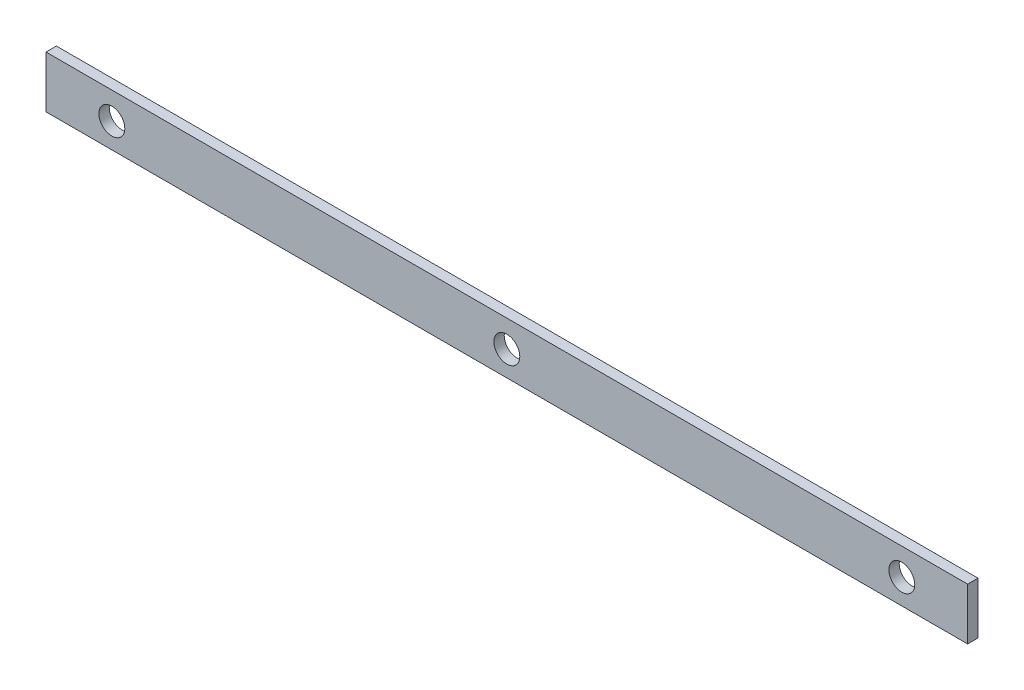
ISO-10303-21;
HEADER;
FILE_DESCRIPTION(('STEP AP214'),'2;1');
FILE_NAME('part.step','',(''),(''),'','','');
FILE_SCHEMA(('AUTOMOTIVE_DESIGN { 1 0 10303 214 1 1 1 1 }'));
ENDSEC;
DATA;
#1=APPLICATION_CONTEXT('core data for automotive mechanical design processes');
#2=APPLICATION_PROTOCOL_DEFINITION('international standard','automotive_design',2000,#1);
#3=PRODUCT_CONTEXT('',#1,'mechanical');
#4=PRODUCT('Part','Part','',(#3));
#5=PRODUCT_RELATED_PRODUCT_CATEGORY('part','',(#4));
#6=PRODUCT_DEFINITION_FORMATION('','',#4);
#7=PRODUCT_DEFINITION_CONTEXT('part definition',#1,'design');
#8=PRODUCT_DEFINITION('design','',#6,#7);
#9=PRODUCT_DEFINITION_SHAPE('','',#8);
#10=(LENGTH_UNIT() NAMED_UNIT(*) SI_UNIT(.MILLI.,.METRE.));
#11=(NAMED_UNIT(*) PLANE_ANGLE_UNIT() SI_UNIT($,.RADIAN.));
#12=(NAMED_UNIT(*) SI_UNIT($,.STERADIAN.) SOLID_ANGLE_UNIT());
#13=UNCERTAINTY_MEASURE_WITH_UNIT(LENGTH_MEASURE(1.E-05),#10,'distance_accuracy_value','');
#14=(GEOMETRIC_REPRESENTATION_CONTEXT(3) GLOBAL_UNCERTAINTY_ASSIGNED_CONTEXT((#13)) GLOBAL_UNIT_ASSIGNED_CONTEXT((#10,
#11,#12)) REPRESENTATION_CONTEXT('',''));
#15=CARTESIAN_POINT('',(0.,0.,0.));
#16=DIRECTION('',(0.,0.,1.));
#17=DIRECTION('',(1.,0.,0.));
#18=AXIS2_PLACEMENT_3D('',#15,#16,#17);
#19=CARTESIAN_POINT('',(-45.4768668006903,-4.80966371940471,2.));
#20=DIRECTION('',(1.,0.,0.));
#21=DIRECTION('',(0.,0.,-1.));
#22=AXIS2_PLACEMENT_3D('',#19,#20,#21);
#23=PLANE('',#22);
#24=DIRECTION('',(0.,-1.,0.));
#25=VECTOR('',#24,1.);
#26=CARTESIAN_POINT('',(-45.4768668006903,-4.80966371940471,0.));
#27=LINE('',#26,#25);
#28=CARTESIAN_POINT('',(-45.4768668006903,5.19033628059529,0.));
#29=VERTEX_POINT('',#28);
#30=CARTESIAN_POINT('',(-45.4768668006903,-4.80966371940471,0.));
#31=VERTEX_POINT('',#30);
#32=EDGE_CURVE('E109',#29,#31,#27,.T.);
#33=ORIENTED_EDGE('',*,*,#32,.T.);
#34=DIRECTION('',(0.,0.,-1.));
#35=VECTOR('',#34,1.);
#36=CARTESIAN_POINT('',(-45.4768668006903,-4.80966371940471,2.));
#37=LINE('',#36,#35);
#38=CARTESIAN_POINT('',(-45.4768668006903,-4.80966371940471,2.));
#39=VERTEX_POINT('',#38);
#40=EDGE_CURVE('E11',#39,#31,#37,.T.);
#41=ORIENTED_EDGE('',*,*,#40,.F.);
#42=DIRECTION('',(0.,-1.,0.));
#43=VECTOR('',#42,1.);
#44=CARTESIAN_POINT('',(-45.4768668006903,-4.80966371940471,2.));
#45=LINE('',#44,#43);
#46=CARTESIAN_POINT('',(-45.4768668006903,5.19033628059529,2.));
#47=VERTEX_POINT('',#46);
#48=EDGE_CURVE('E90',#47,#39,#45,.T.);
#49=ORIENTED_EDGE('',*,*,#48,.F.);
#50=DIRECTION('',(0.,0.,-1.));
#51=VECTOR('',#50,1.);
#52=CARTESIAN_POINT('',(-45.4768668006903,5.19033628059529,2.));
#53=LINE('',#52,#51);
#54=EDGE_CURVE('E105',#47,#29,#53,.T.);
#55=ORIENTED_EDGE('',*,*,#54,.T.);
#56=EDGE_LOOP('',(#33,#41,#49,#55));
#57=FACE_BOUND('',#56,.T.);
#58=ADVANCED_FACE('F36',(#57),#23,.F.);
#59=CARTESIAN_POINT('',(-45.4768668006903,-4.80966371940471,2.));
#60=DIRECTION('',(0.,1.,0.));
#61=DIRECTION('',(0.,0.,1.));
#62=AXIS2_PLACEMENT_3D('',#59,#60,#61);
#63=PLANE('',#62);
#64=DIRECTION('',(1.,0.,0.));
#65=VECTOR('',#64,1.);
#66=CARTESIAN_POINT('',(-45.4768668006903,-4.80966371940471,0.));
#67=LINE('',#66,#65);
#68=CARTESIAN_POINT('',(132.32313319931,-4.80966371940471,0.));
#69=VERTEX_POINT('',#68);
#70=EDGE_CURVE('E95',#31,#69,#67,.T.);
#71=ORIENTED_EDGE('',*,*,#70,.T.);
#72=DIRECTION('',(0.,0.,-1.));
#73=VECTOR('',#72,1.);
#74=CARTESIAN_POINT('',(132.32313319931,-4.80966371940471,2.));
#75=LINE('',#74,#73);
#76=CARTESIAN_POINT('',(132.32313319931,-4.80966371940471,2.));
#77=VERTEX_POINT('',#76);
#78=EDGE_CURVE('E46',#77,#69,#75,.T.);
#79=ORIENTED_EDGE('',*,*,#78,.F.);
#80=DIRECTION('',(1.,0.,0.));
#81=VECTOR('',#80,1.);
#82=CARTESIAN_POINT('',(-45.4768668006903,-4.80966371940471,2.));
#83=LINE('',#82,#81);
#84=EDGE_CURVE('E85',#39,#77,#83,.T.);
#85=ORIENTED_EDGE('',*,*,#84,.F.);
#86=ORIENTED_EDGE('',*,*,#40,.T.);
#87=EDGE_LOOP('',(#71,#79,#85,#86));
#88=FACE_BOUND('',#87,.T.);
#89=ADVANCED_FACE('F94',(#88),#63,.F.);
#90=CARTESIAN_POINT('',(132.32313319931,-4.80966371940471,2.));
#91=DIRECTION('',(-1.,0.,0.));
#92=DIRECTION('',(0.,0.,1.));
#93=AXIS2_PLACEMENT_3D('',#90,#91,#92);
#94=PLANE('',#93);
#95=DIRECTION('',(0.,1.,0.));
#96=VECTOR('',#95,1.);
#97=CARTESIAN_POINT('',(132.32313319931,-4.80966371940471,0.));
#98=LINE('',#97,#96);
#99=CARTESIAN_POINT('',(132.32313319931,5.19033628059529,0.));
#100=VERTEX_POINT('',#99);
#101=EDGE_CURVE('E72',#69,#100,#98,.T.);
#102=ORIENTED_EDGE('',*,*,#101,.T.);
#103=DIRECTION('',(0.,0.,-1.));
#104=VECTOR('',#103,1.);
#105=CARTESIAN_POINT('',(132.32313319931,5.19033628059529,2.));
#106=LINE('',#105,#104);
#107=CARTESIAN_POINT('',(132.32313319931,5.19033628059529,2.));
#108=VERTEX_POINT('',#107);
#109=EDGE_CURVE('E97',#108,#100,#106,.T.);
#110=ORIENTED_EDGE('',*,*,#109,.F.);
#111=DIRECTION('',(0.,1.,0.));
#112=VECTOR('',#111,1.);
#113=CARTESIAN_POINT('',(132.32313319931,-4.80966371940471,2.));
#114=LINE('',#113,#112);
#115=EDGE_CURVE('E88',#77,#108,#114,.T.);
#116=ORIENTED_EDGE('',*,*,#115,.F.);
#117=ORIENTED_EDGE('',*,*,#78,.T.);
#118=EDGE_LOOP('',(#102,#110,#116,#117));
#119=FACE_BOUND('',#118,.T.);
#120=ADVANCED_FACE('F99',(#119),#94,.F.);
#121=CARTESIAN_POINT('',(-45.4768668006903,5.19033628059529,2.));
#122=DIRECTION('',(0.,-1.,0.));
#123=DIRECTION('',(0.,0.,-1.));
#124=AXIS2_PLACEMENT_3D('',#121,#122,#123);
#125=PLANE('',#124);
#126=DIRECTION('',(-1.,0.,0.));
#127=VECTOR('',#126,1.);
#128=CARTESIAN_POINT('',(-45.4768668006903,5.19033628059529,0.));
#129=LINE('',#128,#127);
#130=EDGE_CURVE('E78',#100,#29,#129,.T.);
#131=ORIENTED_EDGE('',*,*,#130,.T.);
#132=ORIENTED_EDGE('',*,*,#54,.F.);
#133=DIRECTION('',(-1.,0.,0.));
#134=VECTOR('',#133,1.);
#135=CARTESIAN_POINT('',(-45.4768668006903,5.19033628059529,2.));
#136=LINE('',#135,#134);
#137=EDGE_CURVE('E55',#108,#47,#136,.T.);
#138=ORIENTED_EDGE('',*,*,#137,.F.);
#139=ORIENTED_EDGE('',*,*,#109,.T.);
#140=EDGE_LOOP('',(#131,#132,#138,#139));
#141=FACE_BOUND('',#140,.T.);
#142=ADVANCED_FACE('F156',(#141),#125,.F.);
#143=CARTESIAN_POINT('',(0.,0.,2.));
#144=DIRECTION('',(0.,0.,-1.));
#145=DIRECTION('',(-1.,0.,0.));
#146=AXIS2_PLACEMENT_3D('',#143,#144,#145);
#147=PLANE('',#146);
#148=CARTESIAN_POINT('',(-32.7768668006903,0.,2.));
#149=DIRECTION('',(0.,0.,1.));
#150=DIRECTION('',(1.,0.,0.));
#151=AXIS2_PLACEMENT_3D('',#148,#149,#150);
#152=CIRCLE('',#151,2.49999999999999);
#153=CARTESIAN_POINT('',(-30.2768668006903,0.,2.));
#154=VERTEX_POINT('',#153);
#155=EDGE_CURVE('E138',#154,#154,#152,.T.);
#156=ORIENTED_EDGE('',*,*,#155,.F.);
#157=EDGE_LOOP('',(#156));
#158=FACE_BOUND('',#157,.T.);
#159=CARTESIAN_POINT('',(43.4231331993097,0.,2.));
#160=DIRECTION('',(0.,0.,1.));
#161=DIRECTION('',(1.,0.,0.));
#162=AXIS2_PLACEMENT_3D('',#159,#160,#161);
#163=CIRCLE('',#162,2.49999999999999);
#164=CARTESIAN_POINT('',(45.9231331993097,0.,2.));
#165=VERTEX_POINT('',#164);
#166=EDGE_CURVE('E125',#165,#165,#163,.T.);
#167=ORIENTED_EDGE('',*,*,#166,.F.);
#168=EDGE_LOOP('',(#167));
#169=FACE_BOUND('',#168,.T.);
#170=CARTESIAN_POINT('',(119.62313319931,0.,2.));
#171=DIRECTION('',(0.,0.,1.));
#172=DIRECTION('',(1.,0.,0.));
#173=AXIS2_PLACEMENT_3D('',#170,#171,#172);
#174=CIRCLE('',#173,2.49999999999999);
#175=CARTESIAN_POINT('',(122.12313319931,0.,2.));
#176=VERTEX_POINT('',#175);
#177=EDGE_CURVE('E124',#176,#176,#174,.T.);
#178=ORIENTED_EDGE('',*,*,#177,.F.);
#179=EDGE_LOOP('',(#178));
#180=FACE_BOUND('',#179,.T.);
#181=ORIENTED_EDGE('',*,*,#48,.T.);
#182=ORIENTED_EDGE('',*,*,#84,.T.);
#183=ORIENTED_EDGE('',*,*,#115,.T.);
#184=ORIENTED_EDGE('',*,*,#137,.T.);
#185=EDGE_LOOP('',(#181,#182,#183,#184));
#186=FACE_BOUND('',#185,.T.);
#187=ADVANCED_FACE('F86',(#158,#169,#180,#186),#147,.F.);
#188=CARTESIAN_POINT('',(0.,0.,0.));
#189=DIRECTION('',(0.,0.,-1.));
#190=DIRECTION('',(-1.,0.,0.));
#191=AXIS2_PLACEMENT_3D('',#188,#189,#190);
#192=PLANE('',#191);
#193=CARTESIAN_POINT('',(-32.7768668006903,0.,0.));
#194=DIRECTION('',(0.,0.,-1.));
#195=DIRECTION('',(-1.,0.,0.));
#196=AXIS2_PLACEMENT_3D('',#193,#194,#195);
#197=CIRCLE('',#196,2.49999999999999);
#198=CARTESIAN_POINT('',(-35.2768668006903,0.,0.));
#199=VERTEX_POINT('',#198);
#200=EDGE_CURVE('E39',#199,#199,#197,.T.);
#201=ORIENTED_EDGE('',*,*,#200,.F.);
#202=EDGE_LOOP('',(#201));
#203=FACE_BOUND('',#202,.T.);
#204=CARTESIAN_POINT('',(43.4231331993097,0.,0.));
#205=DIRECTION('',(0.,0.,-1.));
#206=DIRECTION('',(-1.,0.,0.));
#207=AXIS2_PLACEMENT_3D('',#204,#205,#206);
#208=CIRCLE('',#207,2.49999999999999);
#209=CARTESIAN_POINT('',(40.9231331993097,0.,0.));
#210=VERTEX_POINT('',#209);
#211=EDGE_CURVE('E121',#210,#210,#208,.T.);
#212=ORIENTED_EDGE('',*,*,#211,.F.);
#213=EDGE_LOOP('',(#212));
#214=FACE_BOUND('',#213,.T.);
#215=CARTESIAN_POINT('',(119.62313319931,0.,0.));
#216=DIRECTION('',(0.,0.,-1.));
#217=DIRECTION('',(-1.,0.,0.));
#218=AXIS2_PLACEMENT_3D('',#215,#216,#217);
#219=CIRCLE('',#218,2.49999999999999);
#220=CARTESIAN_POINT('',(117.12313319931,0.,0.));
#221=VERTEX_POINT('',#220);
#222=EDGE_CURVE('E113',#221,#221,#219,.T.);
#223=ORIENTED_EDGE('',*,*,#222,.F.);
#224=EDGE_LOOP('',(#223));
#225=FACE_BOUND('',#224,.T.);
#226=ORIENTED_EDGE('',*,*,#32,.F.);
#227=ORIENTED_EDGE('',*,*,#130,.F.);
#228=ORIENTED_EDGE('',*,*,#101,.F.);
#229=ORIENTED_EDGE('',*,*,#70,.F.);
#230=EDGE_LOOP('',(#226,#227,#228,#229));
#231=FACE_BOUND('',#230,.T.);
#232=ADVANCED_FACE('F149',(#203,#214,#225,#231),#192,.T.);
#233=CARTESIAN_POINT('',(119.62313319931,0.,2.));
#234=DIRECTION('',(0.,0.,1.));
#235=DIRECTION('',(1.,0.,0.));
#236=AXIS2_PLACEMENT_3D('',#233,#234,#235);
#237=CYLINDRICAL_SURFACE('',#236,2.49999999999999);
#238=ORIENTED_EDGE('',*,*,#222,.T.);
#239=EDGE_LOOP('',(#238));
#240=FACE_BOUND('',#239,.T.);
#241=ORIENTED_EDGE('',*,*,#177,.T.);
#242=EDGE_LOOP('',(#241));
#243=FACE_BOUND('',#242,.T.);
#244=ADVANCED_FACE('F146',(#240,#243),#237,.F.);
#245=CARTESIAN_POINT('',(43.4231331993097,0.,2.));
#246=DIRECTION('',(0.,0.,1.));
#247=DIRECTION('',(1.,0.,0.));
#248=AXIS2_PLACEMENT_3D('',#245,#246,#247);
#249=CYLINDRICAL_SURFACE('',#248,2.49999999999999);
#250=ORIENTED_EDGE('',*,*,#211,.T.);
#251=EDGE_LOOP('',(#250));
#252=FACE_BOUND('',#251,.T.);
#253=ORIENTED_EDGE('',*,*,#166,.T.);
#254=EDGE_LOOP('',(#253));
#255=FACE_BOUND('',#254,.T.);
#256=ADVANCED_FACE('F195',(#252,#255),#249,.F.);
#257=CARTESIAN_POINT('',(-32.7768668006903,0.,2.));
#258=DIRECTION('',(0.,0.,1.));
#259=DIRECTION('',(1.,0.,0.));
#260=AXIS2_PLACEMENT_3D('',#257,#258,#259);
#261=CYLINDRICAL_SURFACE('',#260,2.49999999999999);
#262=ORIENTED_EDGE('',*,*,#200,.T.);
#263=EDGE_LOOP('',(#262));
#264=FACE_BOUND('',#263,.T.);
#265=ORIENTED_EDGE('',*,*,#155,.T.);
#266=EDGE_LOOP('',(#265));
#267=FACE_BOUND('',#266,.T.);
#268=ADVANCED_FACE('F203',(#264,#267),#261,.F.);
#269=CLOSED_SHELL('',(#58,#89,#120,#142,#187,#232,#244,#256,#268));
#270=MANIFOLD_SOLID_BREP('B2',#269);
#271=ADVANCED_BREP_SHAPE_REPRESENTATION('',(#18,#270),#14);
#272=SHAPE_DEFINITION_REPRESENTATION(#9,#271);
ENDSEC;
END-ISO-10303-21;
